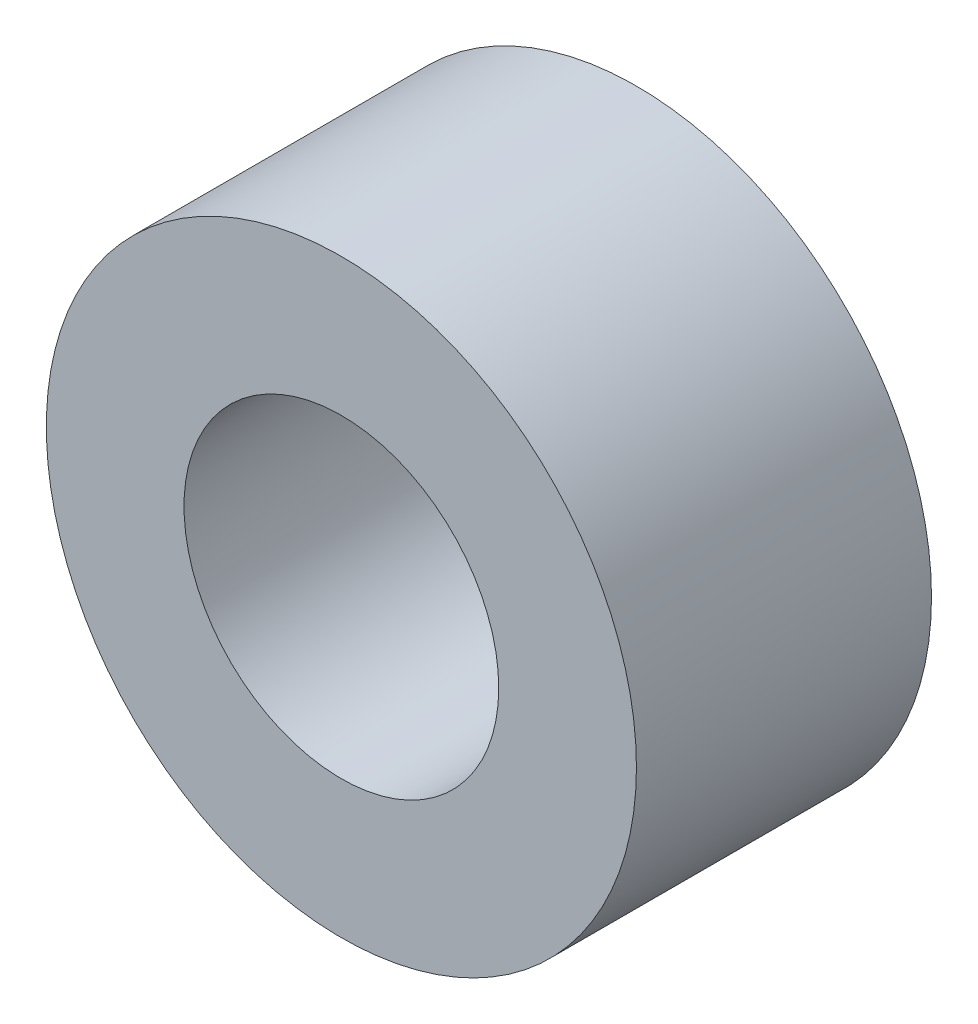
ISO-10303-21;
HEADER;
FILE_DESCRIPTION(('STEP AP214'),'2;1');
FILE_NAME('part.step','',(''),(''),'','','');
FILE_SCHEMA(('AUTOMOTIVE_DESIGN { 1 0 10303 214 1 1 1 1 }'));
ENDSEC;
DATA;
#1=APPLICATION_CONTEXT('core data for automotive mechanical design processes');
#2=APPLICATION_PROTOCOL_DEFINITION('international standard','automotive_design',2000,#1);
#3=PRODUCT_CONTEXT('',#1,'mechanical');
#4=PRODUCT('Part','Part','',(#3));
#5=PRODUCT_RELATED_PRODUCT_CATEGORY('part','',(#4));
#6=PRODUCT_DEFINITION_FORMATION('','',#4);
#7=PRODUCT_DEFINITION_CONTEXT('part definition',#1,'design');
#8=PRODUCT_DEFINITION('design','',#6,#7);
#9=PRODUCT_DEFINITION_SHAPE('','',#8);
#10=(LENGTH_UNIT() NAMED_UNIT(*) SI_UNIT(.MILLI.,.METRE.));
#11=(NAMED_UNIT(*) PLANE_ANGLE_UNIT() SI_UNIT($,.RADIAN.));
#12=(NAMED_UNIT(*) SI_UNIT($,.STERADIAN.) SOLID_ANGLE_UNIT());
#13=UNCERTAINTY_MEASURE_WITH_UNIT(LENGTH_MEASURE(1.E-05),#10,'distance_accuracy_value','');
#14=(GEOMETRIC_REPRESENTATION_CONTEXT(3) GLOBAL_UNCERTAINTY_ASSIGNED_CONTEXT((#13)) GLOBAL_UNIT_ASSIGNED_CONTEXT((#10,
#11,#12)) REPRESENTATION_CONTEXT('',''));
#15=CARTESIAN_POINT('',(0.,0.,0.));
#16=DIRECTION('',(0.,0.,1.));
#17=DIRECTION('',(1.,0.,0.));
#18=AXIS2_PLACEMENT_3D('',#15,#16,#17);
#19=CARTESIAN_POINT('',(0.,0.,1.49999999999995));
#20=DIRECTION('',(0.,0.,1.));
#21=DIRECTION('',(1.,0.,0.));
#22=AXIS2_PLACEMENT_3D('',#19,#20,#21);
#23=PLANE('',#22);
#24=CARTESIAN_POINT('',(0.,0.,1.49999999999995));
#25=DIRECTION('',(0.,0.,1.));
#26=DIRECTION('',(1.,0.,0.));
#27=AXIS2_PLACEMENT_3D('',#24,#25,#26);
#28=CIRCLE('',#27,3.);
#29=CARTESIAN_POINT('',(3.,0.,1.49999999999995));
#30=VERTEX_POINT('',#29);
#31=EDGE_CURVE('E10',#30,#30,#28,.T.);
#32=ORIENTED_EDGE('',*,*,#31,.T.);
#33=EDGE_LOOP('',(#32));
#34=FACE_BOUND('',#33,.T.);
#35=CARTESIAN_POINT('',(0.,0.,1.49999999999995));
#36=DIRECTION('',(0.,0.,1.));
#37=DIRECTION('',(1.,0.,0.));
#38=AXIS2_PLACEMENT_3D('',#35,#36,#37);
#39=CIRCLE('',#38,1.6);
#40=CARTESIAN_POINT('',(1.6,0.,1.49999999999995));
#41=VERTEX_POINT('',#40);
#42=EDGE_CURVE('E41',#41,#41,#39,.T.);
#43=ORIENTED_EDGE('',*,*,#42,.F.);
#44=EDGE_LOOP('',(#43));
#45=FACE_BOUND('',#44,.T.);
#46=ADVANCED_FACE('F30',(#34,#45),#23,.T.);
#47=CARTESIAN_POINT('',(0.,0.,-1.49999999999995));
#48=DIRECTION('',(0.,0.,1.));
#49=DIRECTION('',(1.,0.,0.));
#50=AXIS2_PLACEMENT_3D('',#47,#48,#49);
#51=PLANE('',#50);
#52=CARTESIAN_POINT('',(0.,0.,-1.49999999999995));
#53=DIRECTION('',(0.,0.,1.));
#54=DIRECTION('',(1.,0.,0.));
#55=AXIS2_PLACEMENT_3D('',#52,#53,#54);
#56=CIRCLE('',#55,3.);
#57=CARTESIAN_POINT('',(3.,0.,-1.49999999999995));
#58=VERTEX_POINT('',#57);
#59=EDGE_CURVE('E34',#58,#58,#56,.T.);
#60=ORIENTED_EDGE('',*,*,#59,.F.);
#61=EDGE_LOOP('',(#60));
#62=FACE_BOUND('',#61,.T.);
#63=CARTESIAN_POINT('',(0.,0.,-1.49999999999995));
#64=DIRECTION('',(0.,0.,1.));
#65=DIRECTION('',(1.,0.,0.));
#66=AXIS2_PLACEMENT_3D('',#63,#64,#65);
#67=CIRCLE('',#66,1.6);
#68=CARTESIAN_POINT('',(1.6,0.,-1.49999999999995));
#69=VERTEX_POINT('',#68);
#70=EDGE_CURVE('E43',#69,#69,#67,.T.);
#71=ORIENTED_EDGE('',*,*,#70,.T.);
#72=EDGE_LOOP('',(#71));
#73=FACE_BOUND('',#72,.T.);
#74=ADVANCED_FACE('F53',(#62,#73),#51,.F.);
#75=CARTESIAN_POINT('',(0.,0.,1.49999999999995));
#76=DIRECTION('',(0.,0.,-1.));
#77=DIRECTION('',(-1.,0.,0.));
#78=AXIS2_PLACEMENT_3D('',#75,#76,#77);
#79=CYLINDRICAL_SURFACE('',#78,3.);
#80=ORIENTED_EDGE('',*,*,#31,.F.);
#81=EDGE_LOOP('',(#80));
#82=FACE_BOUND('',#81,.T.);
#83=ORIENTED_EDGE('',*,*,#59,.T.);
#84=EDGE_LOOP('',(#83));
#85=FACE_BOUND('',#84,.T.);
#86=ADVANCED_FACE('F32',(#82,#85),#79,.T.);
#87=CARTESIAN_POINT('',(0.,0.,1.49999999999995));
#88=DIRECTION('',(0.,0.,-1.));
#89=DIRECTION('',(-1.,0.,0.));
#90=AXIS2_PLACEMENT_3D('',#87,#88,#89);
#91=CYLINDRICAL_SURFACE('',#90,1.6);
#92=ORIENTED_EDGE('',*,*,#42,.T.);
#93=EDGE_LOOP('',(#92));
#94=FACE_BOUND('',#93,.T.);
#95=ORIENTED_EDGE('',*,*,#70,.F.);
#96=EDGE_LOOP('',(#95));
#97=FACE_BOUND('',#96,.T.);
#98=ADVANCED_FACE('F49',(#94,#97),#91,.F.);
#99=CLOSED_SHELL('',(#46,#74,#86,#98));
#100=MANIFOLD_SOLID_BREP('B2',#99);
#101=ADVANCED_BREP_SHAPE_REPRESENTATION('',(#18,#100),#14);
#102=SHAPE_DEFINITION_REPRESENTATION(#9,#101);
ENDSEC;
END-ISO-10303-21;
